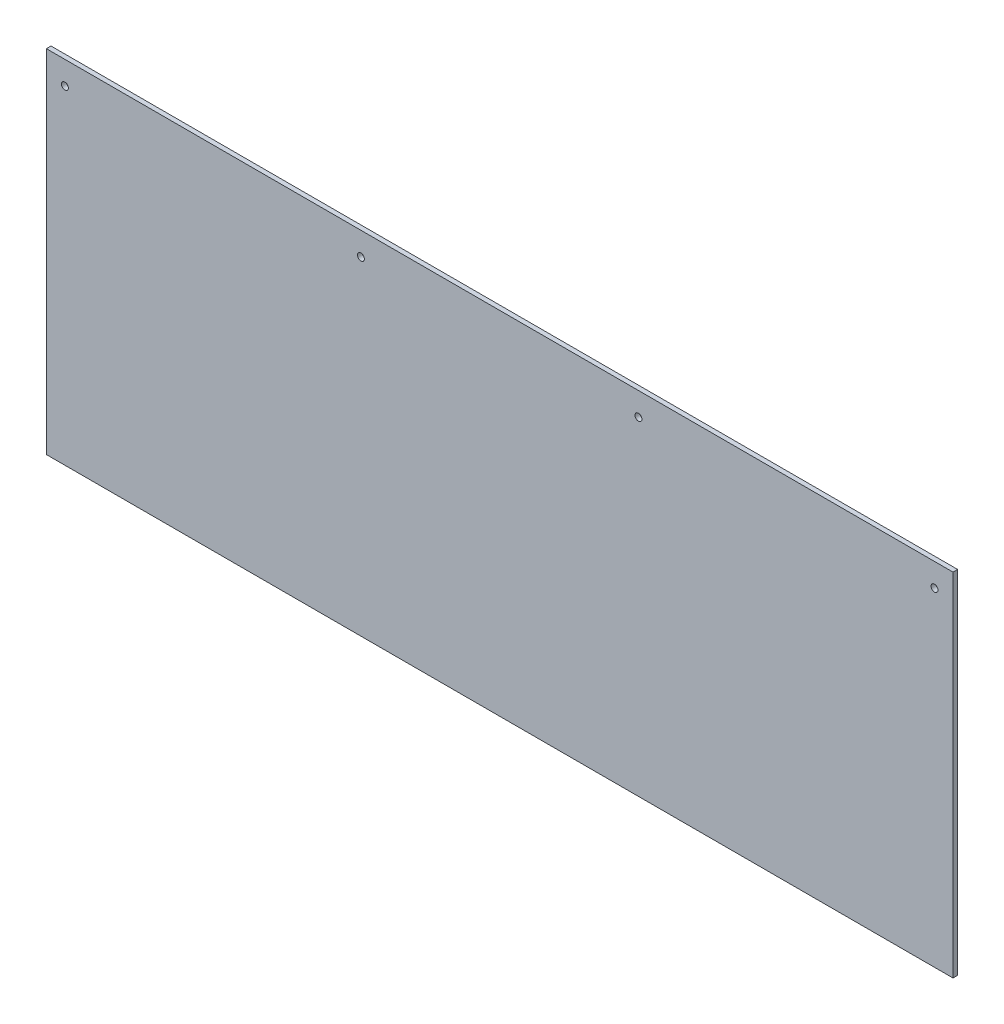
ISO-10303-21;
HEADER;
FILE_DESCRIPTION(('STEP AP214'),'2;1');
FILE_NAME('part.step','',(''),(''),'','','');
FILE_SCHEMA(('AUTOMOTIVE_DESIGN { 1 0 10303 214 1 1 1 1 }'));
ENDSEC;
DATA;
#1=APPLICATION_CONTEXT('core data for automotive mechanical design processes');
#2=APPLICATION_PROTOCOL_DEFINITION('international standard','automotive_design',2000,#1);
#3=PRODUCT_CONTEXT('',#1,'mechanical');
#4=PRODUCT('Part','Part','',(#3));
#5=PRODUCT_RELATED_PRODUCT_CATEGORY('part','',(#4));
#6=PRODUCT_DEFINITION_FORMATION('','',#4);
#7=PRODUCT_DEFINITION_CONTEXT('part definition',#1,'design');
#8=PRODUCT_DEFINITION('design','',#6,#7);
#9=PRODUCT_DEFINITION_SHAPE('','',#8);
#10=(LENGTH_UNIT() NAMED_UNIT(*) SI_UNIT(.MILLI.,.METRE.));
#11=(NAMED_UNIT(*) PLANE_ANGLE_UNIT() SI_UNIT($,.RADIAN.));
#12=(NAMED_UNIT(*) SI_UNIT($,.STERADIAN.) SOLID_ANGLE_UNIT());
#13=UNCERTAINTY_MEASURE_WITH_UNIT(LENGTH_MEASURE(1.E-05),#10,'distance_accuracy_value','');
#14=(GEOMETRIC_REPRESENTATION_CONTEXT(3) GLOBAL_UNCERTAINTY_ASSIGNED_CONTEXT((#13)) GLOBAL_UNIT_ASSIGNED_CONTEXT((#10,
#11,#12)) REPRESENTATION_CONTEXT('',''));
#15=CARTESIAN_POINT('',(0.,0.,0.));
#16=DIRECTION('',(0.,0.,1.));
#17=DIRECTION('',(1.,0.,0.));
#18=AXIS2_PLACEMENT_3D('',#15,#16,#17);
#19=CARTESIAN_POINT('',(0.,0.,6.35));
#20=DIRECTION('',(1.,0.,0.));
#21=DIRECTION('',(0.,0.,-1.));
#22=AXIS2_PLACEMENT_3D('',#19,#20,#21);
#23=PLANE('',#22);
#24=DIRECTION('',(0.,-1.,0.));
#25=VECTOR('',#24,1.);
#26=CARTESIAN_POINT('',(0.,0.,0.));
#27=LINE('',#26,#25);
#28=CARTESIAN_POINT('',(0.,482.6,0.));
#29=VERTEX_POINT('',#28);
#30=CARTESIAN_POINT('',(0.,0.,0.));
#31=VERTEX_POINT('',#30);
#32=EDGE_CURVE('E96',#29,#31,#27,.T.);
#33=ORIENTED_EDGE('',*,*,#32,.T.);
#34=DIRECTION('',(0.,0.,-1.));
#35=VECTOR('',#34,1.);
#36=CARTESIAN_POINT('',(0.,0.,6.35));
#37=LINE('',#36,#35);
#38=CARTESIAN_POINT('',(0.,0.,6.35));
#39=VERTEX_POINT('',#38);
#40=EDGE_CURVE('E11',#39,#31,#37,.T.);
#41=ORIENTED_EDGE('',*,*,#40,.F.);
#42=DIRECTION('',(0.,-1.,0.));
#43=VECTOR('',#42,1.);
#44=CARTESIAN_POINT('',(0.,0.,6.35));
#45=LINE('',#44,#43);
#46=CARTESIAN_POINT('',(0.,482.6,6.35));
#47=VERTEX_POINT('',#46);
#48=EDGE_CURVE('E84',#47,#39,#45,.T.);
#49=ORIENTED_EDGE('',*,*,#48,.F.);
#50=DIRECTION('',(0.,0.,-1.));
#51=VECTOR('',#50,1.);
#52=CARTESIAN_POINT('',(0.,482.6,6.35));
#53=LINE('',#52,#51);
#54=EDGE_CURVE('E92',#47,#29,#53,.T.);
#55=ORIENTED_EDGE('',*,*,#54,.T.);
#56=EDGE_LOOP('',(#33,#41,#49,#55));
#57=FACE_BOUND('',#56,.T.);
#58=ADVANCED_FACE('F33',(#57),#23,.F.);
#59=CARTESIAN_POINT('',(0.,0.,6.35));
#60=DIRECTION('',(0.,1.,0.));
#61=DIRECTION('',(0.,0.,1.));
#62=AXIS2_PLACEMENT_3D('',#59,#60,#61);
#63=PLANE('',#62);
#64=DIRECTION('',(1.,0.,0.));
#65=VECTOR('',#64,1.);
#66=CARTESIAN_POINT('',(0.,0.,0.));
#67=LINE('',#66,#65);
#68=CARTESIAN_POINT('',(1244.6,0.,0.));
#69=VERTEX_POINT('',#68);
#70=EDGE_CURVE('E88',#31,#69,#67,.T.);
#71=ORIENTED_EDGE('',*,*,#70,.T.);
#72=DIRECTION('',(0.,0.,-1.));
#73=VECTOR('',#72,1.);
#74=CARTESIAN_POINT('',(1244.6,0.,6.35));
#75=LINE('',#74,#73);
#76=CARTESIAN_POINT('',(1244.6,0.,6.35));
#77=VERTEX_POINT('',#76);
#78=EDGE_CURVE('E41',#77,#69,#75,.T.);
#79=ORIENTED_EDGE('',*,*,#78,.F.);
#80=DIRECTION('',(1.,0.,0.));
#81=VECTOR('',#80,1.);
#82=CARTESIAN_POINT('',(0.,0.,6.35));
#83=LINE('',#82,#81);
#84=EDGE_CURVE('E79',#39,#77,#83,.T.);
#85=ORIENTED_EDGE('',*,*,#84,.F.);
#86=ORIENTED_EDGE('',*,*,#40,.T.);
#87=EDGE_LOOP('',(#71,#79,#85,#86));
#88=FACE_BOUND('',#87,.T.);
#89=ADVANCED_FACE('F87',(#88),#63,.F.);
#90=CARTESIAN_POINT('',(1244.6,0.,6.35));
#91=DIRECTION('',(-1.,0.,0.));
#92=DIRECTION('',(0.,0.,1.));
#93=AXIS2_PLACEMENT_3D('',#90,#91,#92);
#94=PLANE('',#93);
#95=DIRECTION('',(0.,1.,0.));
#96=VECTOR('',#95,1.);
#97=CARTESIAN_POINT('',(1244.6,0.,0.));
#98=LINE('',#97,#96);
#99=CARTESIAN_POINT('',(1244.6,482.6,0.));
#100=VERTEX_POINT('',#99);
#101=EDGE_CURVE('E66',#69,#100,#98,.T.);
#102=ORIENTED_EDGE('',*,*,#101,.T.);
#103=DIRECTION('',(0.,0.,-1.));
#104=VECTOR('',#103,1.);
#105=CARTESIAN_POINT('',(1244.6,482.6,6.35));
#106=LINE('',#105,#104);
#107=CARTESIAN_POINT('',(1244.6,482.6,6.35));
#108=VERTEX_POINT('',#107);
#109=EDGE_CURVE('E89',#108,#100,#106,.T.);
#110=ORIENTED_EDGE('',*,*,#109,.F.);
#111=DIRECTION('',(0.,1.,0.));
#112=VECTOR('',#111,1.);
#113=CARTESIAN_POINT('',(1244.6,0.,6.35));
#114=LINE('',#113,#112);
#115=EDGE_CURVE('E82',#77,#108,#114,.T.);
#116=ORIENTED_EDGE('',*,*,#115,.F.);
#117=ORIENTED_EDGE('',*,*,#78,.T.);
#118=EDGE_LOOP('',(#102,#110,#116,#117));
#119=FACE_BOUND('',#118,.T.);
#120=ADVANCED_FACE('F90',(#119),#94,.F.);
#121=CARTESIAN_POINT('',(0.,482.6,6.35));
#122=DIRECTION('',(0.,-1.,0.));
#123=DIRECTION('',(1.,0.,0.));
#124=AXIS2_PLACEMENT_3D('',#121,#122,#123);
#125=PLANE('',#124);
#126=DIRECTION('',(-1.,0.,0.));
#127=VECTOR('',#126,1.);
#128=CARTESIAN_POINT('',(0.,482.6,0.));
#129=LINE('',#128,#127);
#130=EDGE_CURVE('E72',#100,#29,#129,.T.);
#131=ORIENTED_EDGE('',*,*,#130,.T.);
#132=ORIENTED_EDGE('',*,*,#54,.F.);
#133=DIRECTION('',(-1.,0.,0.));
#134=VECTOR('',#133,1.);
#135=CARTESIAN_POINT('',(0.,482.6,6.35));
#136=LINE('',#135,#134);
#137=EDGE_CURVE('E49',#108,#47,#136,.T.);
#138=ORIENTED_EDGE('',*,*,#137,.F.);
#139=ORIENTED_EDGE('',*,*,#109,.T.);
#140=EDGE_LOOP('',(#131,#132,#138,#139));
#141=FACE_BOUND('',#140,.T.);
#142=ADVANCED_FACE('F104',(#141),#125,.F.);
#143=CARTESIAN_POINT('',(0.,0.,6.35));
#144=DIRECTION('',(0.,0.,-1.));
#145=DIRECTION('',(-1.,0.,0.));
#146=AXIS2_PLACEMENT_3D('',#143,#144,#145);
#147=PLANE('',#146);
#148=CARTESIAN_POINT('',(25.4,450.85,6.35));
#149=DIRECTION('',(0.,0.,1.));
#150=DIRECTION('',(1.,0.,0.));
#151=AXIS2_PLACEMENT_3D('',#148,#149,#150);
#152=CIRCLE('',#151,4.7625);
#153=CARTESIAN_POINT('',(30.1625,450.85,6.35));
#154=VERTEX_POINT('',#153);
#155=EDGE_CURVE('E128',#154,#154,#152,.T.);
#156=ORIENTED_EDGE('',*,*,#155,.F.);
#157=EDGE_LOOP('',(#156));
#158=FACE_BOUND('',#157,.T.);
#159=CARTESIAN_POINT('',(431.8,450.85,6.35));
#160=DIRECTION('',(0.,0.,1.));
#161=DIRECTION('',(1.,0.,0.));
#162=AXIS2_PLACEMENT_3D('',#159,#160,#161);
#163=CIRCLE('',#162,4.76250000000001);
#164=CARTESIAN_POINT('',(436.5625,450.85,6.35));
#165=VERTEX_POINT('',#164);
#166=EDGE_CURVE('E122',#165,#165,#163,.T.);
#167=ORIENTED_EDGE('',*,*,#166,.F.);
#168=EDGE_LOOP('',(#167));
#169=FACE_BOUND('',#168,.T.);
#170=CARTESIAN_POINT('',(812.8,450.85,6.35));
#171=DIRECTION('',(0.,0.,1.));
#172=DIRECTION('',(1.,0.,0.));
#173=AXIS2_PLACEMENT_3D('',#170,#171,#172);
#174=CIRCLE('',#173,4.76250000000001);
#175=CARTESIAN_POINT('',(817.5625,450.85,6.35));
#176=VERTEX_POINT('',#175);
#177=EDGE_CURVE('E116',#176,#176,#174,.T.);
#178=ORIENTED_EDGE('',*,*,#177,.F.);
#179=EDGE_LOOP('',(#178));
#180=FACE_BOUND('',#179,.T.);
#181=CARTESIAN_POINT('',(1219.2,450.85,6.35));
#182=DIRECTION('',(0.,0.,1.));
#183=DIRECTION('',(1.,0.,0.));
#184=AXIS2_PLACEMENT_3D('',#181,#182,#183);
#185=CIRCLE('',#184,4.7624999999999);
#186=CARTESIAN_POINT('',(1223.9625,450.85,6.35));
#187=VERTEX_POINT('',#186);
#188=EDGE_CURVE('E110',#187,#187,#185,.T.);
#189=ORIENTED_EDGE('',*,*,#188,.F.);
#190=EDGE_LOOP('',(#189));
#191=FACE_BOUND('',#190,.T.);
#192=ORIENTED_EDGE('',*,*,#48,.T.);
#193=ORIENTED_EDGE('',*,*,#84,.T.);
#194=ORIENTED_EDGE('',*,*,#115,.T.);
#195=ORIENTED_EDGE('',*,*,#137,.T.);
#196=EDGE_LOOP('',(#192,#193,#194,#195));
#197=FACE_BOUND('',#196,.T.);
#198=ADVANCED_FACE('F80',(#158,#169,#180,#191,#197),#147,.F.);
#199=CARTESIAN_POINT('',(0.,0.,0.));
#200=DIRECTION('',(0.,0.,-1.));
#201=DIRECTION('',(-1.,0.,0.));
#202=AXIS2_PLACEMENT_3D('',#199,#200,#201);
#203=PLANE('',#202);
#204=CARTESIAN_POINT('',(25.4,450.85,0.));
#205=DIRECTION('',(0.,0.,1.));
#206=DIRECTION('',(1.,0.,0.));
#207=AXIS2_PLACEMENT_3D('',#204,#205,#206);
#208=CIRCLE('',#207,4.7625);
#209=CARTESIAN_POINT('',(30.1625,450.85,0.));
#210=VERTEX_POINT('',#209);
#211=EDGE_CURVE('E99',#210,#210,#208,.T.);
#212=ORIENTED_EDGE('',*,*,#211,.T.);
#213=EDGE_LOOP('',(#212));
#214=FACE_BOUND('',#213,.T.);
#215=CARTESIAN_POINT('',(431.8,450.85,0.));
#216=DIRECTION('',(0.,0.,1.));
#217=DIRECTION('',(1.,0.,0.));
#218=AXIS2_PLACEMENT_3D('',#215,#216,#217);
#219=CIRCLE('',#218,4.76250000000001);
#220=CARTESIAN_POINT('',(436.5625,450.85,0.));
#221=VERTEX_POINT('',#220);
#222=EDGE_CURVE('E125',#221,#221,#219,.T.);
#223=ORIENTED_EDGE('',*,*,#222,.T.);
#224=EDGE_LOOP('',(#223));
#225=FACE_BOUND('',#224,.T.);
#226=CARTESIAN_POINT('',(812.8,450.85,0.));
#227=DIRECTION('',(0.,0.,1.));
#228=DIRECTION('',(1.,0.,0.));
#229=AXIS2_PLACEMENT_3D('',#226,#227,#228);
#230=CIRCLE('',#229,4.76250000000001);
#231=CARTESIAN_POINT('',(817.5625,450.85,0.));
#232=VERTEX_POINT('',#231);
#233=EDGE_CURVE('E119',#232,#232,#230,.T.);
#234=ORIENTED_EDGE('',*,*,#233,.T.);
#235=EDGE_LOOP('',(#234));
#236=FACE_BOUND('',#235,.T.);
#237=CARTESIAN_POINT('',(1219.2,450.85,0.));
#238=DIRECTION('',(0.,0.,1.));
#239=DIRECTION('',(1.,0.,0.));
#240=AXIS2_PLACEMENT_3D('',#237,#238,#239);
#241=CIRCLE('',#240,4.7624999999999);
#242=CARTESIAN_POINT('',(1223.9625,450.85,0.));
#243=VERTEX_POINT('',#242);
#244=EDGE_CURVE('E113',#243,#243,#241,.T.);
#245=ORIENTED_EDGE('',*,*,#244,.T.);
#246=EDGE_LOOP('',(#245));
#247=FACE_BOUND('',#246,.T.);
#248=ORIENTED_EDGE('',*,*,#32,.F.);
#249=ORIENTED_EDGE('',*,*,#130,.F.);
#250=ORIENTED_EDGE('',*,*,#101,.F.);
#251=ORIENTED_EDGE('',*,*,#70,.F.);
#252=EDGE_LOOP('',(#248,#249,#250,#251));
#253=FACE_BOUND('',#252,.T.);
#254=ADVANCED_FACE('F107',(#214,#225,#236,#247,#253),#203,.T.);
#255=CARTESIAN_POINT('',(1219.2,450.85,0.));
#256=DIRECTION('',(0.,0.,1.));
#257=DIRECTION('',(1.,0.,0.));
#258=AXIS2_PLACEMENT_3D('',#255,#256,#257);
#259=CYLINDRICAL_SURFACE('',#258,4.7624999999999);
#260=ORIENTED_EDGE('',*,*,#244,.F.);
#261=EDGE_LOOP('',(#260));
#262=FACE_BOUND('',#261,.T.);
#263=ORIENTED_EDGE('',*,*,#188,.T.);
#264=EDGE_LOOP('',(#263));
#265=FACE_BOUND('',#264,.T.);
#266=ADVANCED_FACE('F152',(#262,#265),#259,.F.);
#267=CARTESIAN_POINT('',(812.8,450.85,0.));
#268=DIRECTION('',(0.,0.,1.));
#269=DIRECTION('',(1.,0.,0.));
#270=AXIS2_PLACEMENT_3D('',#267,#268,#269);
#271=CYLINDRICAL_SURFACE('',#270,4.76250000000001);
#272=ORIENTED_EDGE('',*,*,#233,.F.);
#273=EDGE_LOOP('',(#272));
#274=FACE_BOUND('',#273,.T.);
#275=ORIENTED_EDGE('',*,*,#177,.T.);
#276=EDGE_LOOP('',(#275));
#277=FACE_BOUND('',#276,.T.);
#278=ADVANCED_FACE('F154',(#274,#277),#271,.F.);
#279=CARTESIAN_POINT('',(431.8,450.85,0.));
#280=DIRECTION('',(0.,0.,1.));
#281=DIRECTION('',(1.,0.,0.));
#282=AXIS2_PLACEMENT_3D('',#279,#280,#281);
#283=CYLINDRICAL_SURFACE('',#282,4.76250000000001);
#284=ORIENTED_EDGE('',*,*,#222,.F.);
#285=EDGE_LOOP('',(#284));
#286=FACE_BOUND('',#285,.T.);
#287=ORIENTED_EDGE('',*,*,#166,.T.);
#288=EDGE_LOOP('',(#287));
#289=FACE_BOUND('',#288,.T.);
#290=ADVANCED_FACE('F139',(#286,#289),#283,.F.);
#291=CARTESIAN_POINT('',(25.4,450.85,0.));
#292=DIRECTION('',(0.,0.,1.));
#293=DIRECTION('',(1.,0.,0.));
#294=AXIS2_PLACEMENT_3D('',#291,#292,#293);
#295=CYLINDRICAL_SURFACE('',#294,4.7625);
#296=ORIENTED_EDGE('',*,*,#211,.F.);
#297=EDGE_LOOP('',(#296));
#298=FACE_BOUND('',#297,.T.);
#299=ORIENTED_EDGE('',*,*,#155,.T.);
#300=EDGE_LOOP('',(#299));
#301=FACE_BOUND('',#300,.T.);
#302=ADVANCED_FACE('F136',(#298,#301),#295,.F.);
#303=CLOSED_SHELL('',(#58,#89,#120,#142,#198,#254,#266,#278,#290,#302));
#304=MANIFOLD_SOLID_BREP('B2',#303);
#305=ADVANCED_BREP_SHAPE_REPRESENTATION('',(#18,#304),#14);
#306=SHAPE_DEFINITION_REPRESENTATION(#9,#305);
ENDSEC;
END-ISO-10303-21;
